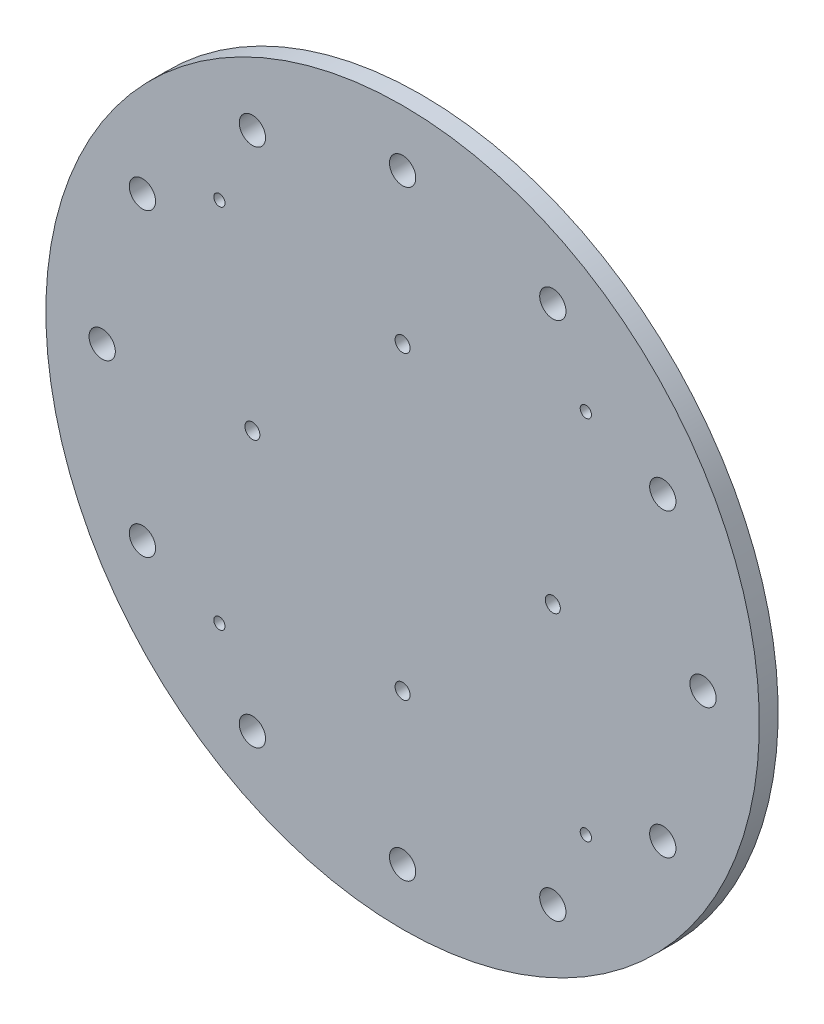
ISO-10303-21;
HEADER;
FILE_DESCRIPTION(('STEP AP214'),'2;1');
FILE_NAME('part.step','',(''),(''),'','','');
FILE_SCHEMA(('AUTOMOTIVE_DESIGN { 1 0 10303 214 1 1 1 1 }'));
ENDSEC;
DATA;
#1=APPLICATION_CONTEXT('core data for automotive mechanical design processes');
#2=APPLICATION_PROTOCOL_DEFINITION('international standard','automotive_design',2000,#1);
#3=PRODUCT_CONTEXT('',#1,'mechanical');
#4=PRODUCT('Part','Part','',(#3));
#5=PRODUCT_RELATED_PRODUCT_CATEGORY('part','',(#4));
#6=PRODUCT_DEFINITION_FORMATION('','',#4);
#7=PRODUCT_DEFINITION_CONTEXT('part definition',#1,'design');
#8=PRODUCT_DEFINITION('design','',#6,#7);
#9=PRODUCT_DEFINITION_SHAPE('','',#8);
#10=(LENGTH_UNIT() NAMED_UNIT(*) SI_UNIT(.MILLI.,.METRE.));
#11=(NAMED_UNIT(*) PLANE_ANGLE_UNIT() SI_UNIT($,.RADIAN.));
#12=(NAMED_UNIT(*) SI_UNIT($,.STERADIAN.) SOLID_ANGLE_UNIT());
#13=UNCERTAINTY_MEASURE_WITH_UNIT(LENGTH_MEASURE(1.E-05),#10,'distance_accuracy_value','');
#14=(GEOMETRIC_REPRESENTATION_CONTEXT(3) GLOBAL_UNCERTAINTY_ASSIGNED_CONTEXT((#13)) GLOBAL_UNIT_ASSIGNED_CONTEXT((#10,
#11,#12)) REPRESENTATION_CONTEXT('',''));
#15=CARTESIAN_POINT('',(0.,0.,0.));
#16=DIRECTION('',(0.,0.,1.));
#17=DIRECTION('',(1.,0.,0.));
#18=AXIS2_PLACEMENT_3D('',#15,#16,#17);
#19=CARTESIAN_POINT('',(-48.7903679018713,51.2903679018705,2.50000000003424));
#20=DIRECTION('',(0.,7.01834423910697E-13,-1.));
#21=DIRECTION('',(0.,1.,7.01834423910697E-13));
#22=AXIS2_PLACEMENT_3D('',#19,#20,#21);
#23=CYLINDRICAL_SURFACE('',#22,1.49999999999999);
#24=CARTESIAN_POINT('',(-48.7903679018713,51.2903679018705,2.50000000003424));
#25=DIRECTION('',(0.,-7.01834423910697E-13,1.));
#26=DIRECTION('',(0.,-1.,-7.01834423910697E-13));
#27=AXIS2_PLACEMENT_3D('',#24,#25,#26);
#28=CIRCLE('',#27,1.49999999999999);
#29=CARTESIAN_POINT('',(-48.7903679018713,49.7903679018705,2.50000000003319));
#30=VERTEX_POINT('',#29);
#31=EDGE_CURVE('E51',#30,#30,#28,.T.);
#32=ORIENTED_EDGE('',*,*,#31,.T.);
#33=EDGE_LOOP('',(#32));
#34=FACE_BOUND('',#33,.T.);
#35=CARTESIAN_POINT('',(-48.7903679018713,51.290367901874,-2.49999999996576));
#36=DIRECTION('',(0.,-7.01834423910697E-13,1.));
#37=DIRECTION('',(0.,-1.,-7.01834423910697E-13));
#38=AXIS2_PLACEMENT_3D('',#35,#36,#37);
#39=CIRCLE('',#38,1.49999999999999);
#40=CARTESIAN_POINT('',(-48.7903679018713,49.790367901874,-2.49999999996682));
#41=VERTEX_POINT('',#40);
#42=EDGE_CURVE('E136',#41,#41,#39,.T.);
#43=ORIENTED_EDGE('',*,*,#42,.F.);
#44=EDGE_LOOP('',(#43));
#45=FACE_BOUND('',#44,.T.);
#46=ADVANCED_FACE('F42',(#34,#45),#23,.F.);
#47=CARTESIAN_POINT('',(-48.7903679018718,-46.2903679018736,2.49999999996575));
#48=DIRECTION('',(0.,7.01834423910697E-13,-1.));
#49=DIRECTION('',(0.,1.,7.01834423910697E-13));
#50=AXIS2_PLACEMENT_3D('',#47,#48,#49);
#51=CYLINDRICAL_SURFACE('',#50,1.50000000000018);
#52=CARTESIAN_POINT('',(-48.7903679018718,-46.2903679018736,2.49999999996575));
#53=DIRECTION('',(0.,-7.01834423910697E-13,1.));
#54=DIRECTION('',(0.,-1.,-7.01834423910697E-13));
#55=AXIS2_PLACEMENT_3D('',#52,#53,#54);
#56=CIRCLE('',#55,1.50000000000018);
#57=CARTESIAN_POINT('',(-48.7903679018718,-47.7903679018737,2.4999999999647));
#58=VERTEX_POINT('',#57);
#59=EDGE_CURVE('E57',#58,#58,#56,.T.);
#60=ORIENTED_EDGE('',*,*,#59,.T.);
#61=EDGE_LOOP('',(#60));
#62=FACE_BOUND('',#61,.T.);
#63=CARTESIAN_POINT('',(-48.7903679018718,-46.29036790187,-2.50000000003425));
#64=DIRECTION('',(0.,-7.01834423910697E-13,1.));
#65=DIRECTION('',(0.,-1.,-7.01834423910697E-13));
#66=AXIS2_PLACEMENT_3D('',#63,#64,#65);
#67=CIRCLE('',#66,1.50000000000018);
#68=CARTESIAN_POINT('',(-48.7903679018718,-47.7903679018702,-2.5000000000353));
#69=VERTEX_POINT('',#68);
#70=EDGE_CURVE('E133',#69,#69,#67,.T.);
#71=ORIENTED_EDGE('',*,*,#70,.F.);
#72=EDGE_LOOP('',(#71));
#73=FACE_BOUND('',#72,.T.);
#74=ADVANCED_FACE('F223',(#62,#73),#51,.F.);
#75=CARTESIAN_POINT('',(48.7903679018717,-46.2903679018736,2.49999999996575));
#76=DIRECTION('',(0.,7.01834423910697E-13,-1.));
#77=DIRECTION('',(0.,1.,7.01834423910697E-13));
#78=AXIS2_PLACEMENT_3D('',#75,#76,#77);
#79=CYLINDRICAL_SURFACE('',#78,1.5);
#80=CARTESIAN_POINT('',(48.7903679018717,-46.2903679018736,2.49999999996575));
#81=DIRECTION('',(0.,-7.01834423910697E-13,1.));
#82=DIRECTION('',(0.,-1.,-7.01834423910697E-13));
#83=AXIS2_PLACEMENT_3D('',#80,#81,#82);
#84=CIRCLE('',#83,1.5);
#85=CARTESIAN_POINT('',(48.7903679018717,-47.7903679018736,2.4999999999647));
#86=VERTEX_POINT('',#85);
#87=EDGE_CURVE('E216',#86,#86,#84,.T.);
#88=ORIENTED_EDGE('',*,*,#87,.T.);
#89=EDGE_LOOP('',(#88));
#90=FACE_BOUND('',#89,.T.);
#91=CARTESIAN_POINT('',(48.7903679018717,-46.2903679018701,-2.50000000003425));
#92=DIRECTION('',(0.,-7.01834423910697E-13,1.));
#93=DIRECTION('',(0.,-1.,-7.01834423910697E-13));
#94=AXIS2_PLACEMENT_3D('',#91,#92,#93);
#95=CIRCLE('',#94,1.5);
#96=CARTESIAN_POINT('',(48.7903679018717,-47.7903679018701,-2.5000000000353));
#97=VERTEX_POINT('',#96);
#98=EDGE_CURVE('E129',#97,#97,#95,.T.);
#99=ORIENTED_EDGE('',*,*,#98,.F.);
#100=EDGE_LOOP('',(#99));
#101=FACE_BOUND('',#100,.T.);
#102=ADVANCED_FACE('F241',(#90,#101),#79,.F.);
#103=CARTESIAN_POINT('',(-40.0000000000011,2.49999999999824,2.5));
#104=DIRECTION('',(0.,7.01834423910697E-13,-1.));
#105=DIRECTION('',(0.,1.,7.01834423910697E-13));
#106=AXIS2_PLACEMENT_3D('',#103,#104,#105);
#107=CYLINDRICAL_SURFACE('',#106,2.00000000000008);
#108=CARTESIAN_POINT('',(-40.0000000000011,2.49999999999824,2.5));
#109=DIRECTION('',(0.,-7.01834423910697E-13,1.));
#110=DIRECTION('',(0.,-1.,-7.01834423910697E-13));
#111=AXIS2_PLACEMENT_3D('',#108,#109,#110);
#112=CIRCLE('',#111,2.00000000000008);
#113=CARTESIAN_POINT('',(-40.0000000000011,0.499999999998163,2.49999999999859));
#114=VERTEX_POINT('',#113);
#115=EDGE_CURVE('E212',#114,#114,#112,.T.);
#116=ORIENTED_EDGE('',*,*,#115,.T.);
#117=EDGE_LOOP('',(#116));
#118=FACE_BOUND('',#117,.T.);
#119=CARTESIAN_POINT('',(-40.0000000000011,2.50000000000175,-2.50000000000001));
#120=DIRECTION('',(0.,-7.01834423910697E-13,1.));
#121=DIRECTION('',(0.,-1.,-7.01834423910697E-13));
#122=AXIS2_PLACEMENT_3D('',#119,#120,#121);
#123=CIRCLE('',#122,2.00000000000008);
#124=CARTESIAN_POINT('',(-40.0000000000011,0.500000000001672,-2.50000000000141));
#125=VERTEX_POINT('',#124);
#126=EDGE_CURVE('E125',#125,#125,#123,.T.);
#127=ORIENTED_EDGE('',*,*,#126,.F.);
#128=EDGE_LOOP('',(#127));
#129=FACE_BOUND('',#128,.T.);
#130=ADVANCED_FACE('F248',(#118,#129),#107,.F.);
#131=CARTESIAN_POINT('',(-2.79318507107451E-13,-37.5000000000018,2.49999999997192));
#132=DIRECTION('',(0.,7.01834423910697E-13,-1.));
#133=DIRECTION('',(0.,1.,7.01834423910697E-13));
#134=AXIS2_PLACEMENT_3D('',#131,#132,#133);
#135=CYLINDRICAL_SURFACE('',#134,2.);
#136=CARTESIAN_POINT('',(-2.79318507107451E-13,-37.5000000000018,2.49999999997192));
#137=DIRECTION('',(0.,-7.01834423910697E-13,1.));
#138=DIRECTION('',(0.,-1.,-7.01834423910697E-13));
#139=AXIS2_PLACEMENT_3D('',#136,#137,#138);
#140=CIRCLE('',#139,2.);
#141=CARTESIAN_POINT('',(-2.79318507107451E-13,-39.5000000000018,2.49999999997052));
#142=VERTEX_POINT('',#141);
#143=EDGE_CURVE('E208',#142,#142,#140,.T.);
#144=ORIENTED_EDGE('',*,*,#143,.T.);
#145=EDGE_LOOP('',(#144));
#146=FACE_BOUND('',#145,.T.);
#147=CARTESIAN_POINT('',(-2.79318507107451E-13,-37.4999999999983,-2.50000000002808));
#148=DIRECTION('',(0.,-7.01834423910697E-13,1.));
#149=DIRECTION('',(0.,-1.,-7.01834423910697E-13));
#150=AXIS2_PLACEMENT_3D('',#147,#148,#149);
#151=CIRCLE('',#150,2.);
#152=CARTESIAN_POINT('',(-2.79318507107451E-13,-39.4999999999982,-2.50000000002948));
#153=VERTEX_POINT('',#152);
#154=EDGE_CURVE('E121',#153,#153,#151,.T.);
#155=ORIENTED_EDGE('',*,*,#154,.F.);
#156=EDGE_LOOP('',(#155));
#157=FACE_BOUND('',#156,.T.);
#158=ADVANCED_FACE('F252',(#146,#157),#135,.F.);
#159=CARTESIAN_POINT('',(40.,2.49999999999811,2.5));
#160=DIRECTION('',(0.,7.01834423910697E-13,-1.));
#161=DIRECTION('',(0.,1.,7.01834423910697E-13));
#162=AXIS2_PLACEMENT_3D('',#159,#160,#161);
#163=CYLINDRICAL_SURFACE('',#162,2.);
#164=CARTESIAN_POINT('',(40.,2.49999999999811,2.5));
#165=DIRECTION('',(0.,-7.01834423910697E-13,1.));
#166=DIRECTION('',(0.,-1.,-7.01834423910697E-13));
#167=AXIS2_PLACEMENT_3D('',#164,#165,#166);
#168=CIRCLE('',#167,2.);
#169=CARTESIAN_POINT('',(40.,0.499999999998109,2.49999999999859));
#170=VERTEX_POINT('',#169);
#171=EDGE_CURVE('E204',#170,#170,#168,.T.);
#172=ORIENTED_EDGE('',*,*,#171,.T.);
#173=EDGE_LOOP('',(#172));
#174=FACE_BOUND('',#173,.T.);
#175=CARTESIAN_POINT('',(40.,2.50000000000162,-2.50000000000001));
#176=DIRECTION('',(0.,-7.01834423910697E-13,1.));
#177=DIRECTION('',(0.,-1.,-7.01834423910697E-13));
#178=AXIS2_PLACEMENT_3D('',#175,#176,#177);
#179=CIRCLE('',#178,2.);
#180=CARTESIAN_POINT('',(40.,0.500000000001618,-2.50000000000141));
#181=VERTEX_POINT('',#180);
#182=EDGE_CURVE('E117',#181,#181,#179,.T.);
#183=ORIENTED_EDGE('',*,*,#182,.F.);
#184=EDGE_LOOP('',(#183));
#185=FACE_BOUND('',#184,.T.);
#186=ADVANCED_FACE('F256',(#174,#185),#163,.F.);
#187=CARTESIAN_POINT('',(0.,42.4999999999983,2.50000000002807));
#188=DIRECTION('',(0.,7.01834423910697E-13,-1.));
#189=DIRECTION('',(0.,1.,7.01834423910697E-13));
#190=AXIS2_PLACEMENT_3D('',#187,#188,#189);
#191=CYLINDRICAL_SURFACE('',#190,2.);
#192=CARTESIAN_POINT('',(0.,42.4999999999983,2.50000000002807));
#193=DIRECTION('',(0.,-7.01834423910697E-13,1.));
#194=DIRECTION('',(0.,-1.,-7.01834423910697E-13));
#195=AXIS2_PLACEMENT_3D('',#192,#193,#194);
#196=CIRCLE('',#195,2.);
#197=CARTESIAN_POINT('',(0.,40.4999999999983,2.50000000002666));
#198=VERTEX_POINT('',#197);
#199=EDGE_CURVE('E200',#198,#198,#196,.T.);
#200=ORIENTED_EDGE('',*,*,#199,.T.);
#201=EDGE_LOOP('',(#200));
#202=FACE_BOUND('',#201,.T.);
#203=CARTESIAN_POINT('',(0.,42.5000000000018,-2.49999999997193));
#204=DIRECTION('',(0.,-7.01834423910697E-13,1.));
#205=DIRECTION('',(0.,-1.,-7.01834423910697E-13));
#206=AXIS2_PLACEMENT_3D('',#203,#204,#205);
#207=CIRCLE('',#206,2.);
#208=CARTESIAN_POINT('',(0.,40.5000000000018,-2.49999999997334));
#209=VERTEX_POINT('',#208);
#210=EDGE_CURVE('E113',#209,#209,#207,.T.);
#211=ORIENTED_EDGE('',*,*,#210,.F.);
#212=EDGE_LOOP('',(#211));
#213=FACE_BOUND('',#212,.T.);
#214=ADVANCED_FACE('F260',(#202,#213),#191,.F.);
#215=CARTESIAN_POINT('',(48.7903679018717,51.2903679018701,2.50000000003424));
#216=DIRECTION('',(0.,7.01834423910697E-13,-1.));
#217=DIRECTION('',(0.,1.,7.01834423910697E-13));
#218=AXIS2_PLACEMENT_3D('',#215,#216,#217);
#219=CYLINDRICAL_SURFACE('',#218,1.5);
#220=CARTESIAN_POINT('',(48.7903679018717,51.2903679018701,2.50000000003424));
#221=DIRECTION('',(0.,-7.01834423910697E-13,1.));
#222=DIRECTION('',(0.,-1.,-7.01834423910697E-13));
#223=AXIS2_PLACEMENT_3D('',#220,#221,#222);
#224=CIRCLE('',#223,1.5);
#225=CARTESIAN_POINT('',(48.7903679018717,49.7903679018701,2.50000000003319));
#226=VERTEX_POINT('',#225);
#227=EDGE_CURVE('E196',#226,#226,#224,.T.);
#228=ORIENTED_EDGE('',*,*,#227,.T.);
#229=EDGE_LOOP('',(#228));
#230=FACE_BOUND('',#229,.T.);
#231=CARTESIAN_POINT('',(48.7903679018717,51.2903679018736,-2.49999999996576));
#232=DIRECTION('',(0.,-7.01834423910697E-13,1.));
#233=DIRECTION('',(0.,-1.,-7.01834423910697E-13));
#234=AXIS2_PLACEMENT_3D('',#231,#232,#233);
#235=CIRCLE('',#234,1.5);
#236=CARTESIAN_POINT('',(48.7903679018717,49.7903679018736,-2.49999999996682));
#237=VERTEX_POINT('',#236);
#238=EDGE_CURVE('E109',#237,#237,#235,.T.);
#239=ORIENTED_EDGE('',*,*,#238,.F.);
#240=EDGE_LOOP('',(#239));
#241=FACE_BOUND('',#240,.T.);
#242=ADVANCED_FACE('F264',(#230,#241),#219,.F.);
#243=CARTESIAN_POINT('',(80.,2.49999999999825,2.5));
#244=DIRECTION('',(0.,7.01834423910697E-13,-1.));
#245=DIRECTION('',(0.,1.,7.01834423910697E-13));
#246=AXIS2_PLACEMENT_3D('',#243,#244,#245);
#247=CYLINDRICAL_SURFACE('',#246,3.49999999999999);
#248=CARTESIAN_POINT('',(80.,2.49999999999825,2.5));
#249=DIRECTION('',(0.,-7.01834423910697E-13,1.));
#250=DIRECTION('',(0.,-1.,-7.01834423910697E-13));
#251=AXIS2_PLACEMENT_3D('',#248,#249,#250);
#252=CIRCLE('',#251,3.49999999999999);
#253=CARTESIAN_POINT('',(80.,-1.00000000000175,2.49999999999754));
#254=VERTEX_POINT('',#253);
#255=EDGE_CURVE('E192',#254,#254,#252,.T.);
#256=ORIENTED_EDGE('',*,*,#255,.T.);
#257=EDGE_LOOP('',(#256));
#258=FACE_BOUND('',#257,.T.);
#259=CARTESIAN_POINT('',(80.,2.50000000000176,-2.50000000000001));
#260=DIRECTION('',(0.,-7.01834423910697E-13,1.));
#261=DIRECTION('',(0.,-1.,-7.01834423910697E-13));
#262=AXIS2_PLACEMENT_3D('',#259,#260,#261);
#263=CIRCLE('',#262,3.49999999999999);
#264=CARTESIAN_POINT('',(80.,-0.999999999998238,-2.50000000000246));
#265=VERTEX_POINT('',#264);
#266=EDGE_CURVE('E105',#265,#265,#263,.T.);
#267=ORIENTED_EDGE('',*,*,#266,.F.);
#268=EDGE_LOOP('',(#267));
#269=FACE_BOUND('',#268,.T.);
#270=ADVANCED_FACE('F268',(#258,#269),#247,.F.);
#271=CARTESIAN_POINT('',(69.2820323027551,-37.5000000000019,2.49999999997192));
#272=DIRECTION('',(0.,7.01834423910697E-13,-1.));
#273=DIRECTION('',(0.,1.,7.01834423910697E-13));
#274=AXIS2_PLACEMENT_3D('',#271,#272,#273);
#275=CYLINDRICAL_SURFACE('',#274,3.49999999999998);
#276=CARTESIAN_POINT('',(69.2820323027551,-37.5000000000019,2.49999999997192));
#277=DIRECTION('',(0.,-7.01834423910697E-13,1.));
#278=DIRECTION('',(0.,-1.,-7.01834423910697E-13));
#279=AXIS2_PLACEMENT_3D('',#276,#277,#278);
#280=CIRCLE('',#279,3.49999999999998);
#281=CARTESIAN_POINT('',(69.2820323027551,-41.0000000000018,2.49999999996947));
#282=VERTEX_POINT('',#281);
#283=EDGE_CURVE('E188',#282,#282,#280,.T.);
#284=ORIENTED_EDGE('',*,*,#283,.T.);
#285=EDGE_LOOP('',(#284));
#286=FACE_BOUND('',#285,.T.);
#287=CARTESIAN_POINT('',(69.2820323027551,-37.4999999999983,-2.50000000002808));
#288=DIRECTION('',(0.,-7.01834423910697E-13,1.));
#289=DIRECTION('',(0.,-1.,-7.01834423910697E-13));
#290=AXIS2_PLACEMENT_3D('',#287,#288,#289);
#291=CIRCLE('',#290,3.49999999999998);
#292=CARTESIAN_POINT('',(69.2820323027551,-40.9999999999983,-2.50000000003054));
#293=VERTEX_POINT('',#292);
#294=EDGE_CURVE('E101',#293,#293,#291,.T.);
#295=ORIENTED_EDGE('',*,*,#294,.F.);
#296=EDGE_LOOP('',(#295));
#297=FACE_BOUND('',#296,.T.);
#298=ADVANCED_FACE('F272',(#286,#297),#275,.F.);
#299=CARTESIAN_POINT('',(39.9999999999998,-66.782032302757,2.49999999995137));
#300=DIRECTION('',(0.,7.01834423910697E-13,-1.));
#301=DIRECTION('',(0.,1.,7.01834423910697E-13));
#302=AXIS2_PLACEMENT_3D('',#299,#300,#301);
#303=CYLINDRICAL_SURFACE('',#302,3.49999999999999);
#304=CARTESIAN_POINT('',(39.9999999999998,-66.782032302757,2.49999999995137));
#305=DIRECTION('',(0.,-7.01834423910697E-13,1.));
#306=DIRECTION('',(0.,-1.,-7.01834423910697E-13));
#307=AXIS2_PLACEMENT_3D('',#304,#305,#306);
#308=CIRCLE('',#307,3.49999999999999);
#309=CARTESIAN_POINT('',(39.9999999999998,-70.2820323027569,2.49999999994892));
#310=VERTEX_POINT('',#309);
#311=EDGE_CURVE('E184',#310,#310,#308,.T.);
#312=ORIENTED_EDGE('',*,*,#311,.T.);
#313=EDGE_LOOP('',(#312));
#314=FACE_BOUND('',#313,.T.);
#315=CARTESIAN_POINT('',(39.9999999999998,-66.7820323027534,-2.50000000004863));
#316=DIRECTION('',(0.,-7.01834423910697E-13,1.));
#317=DIRECTION('',(0.,-1.,-7.01834423910697E-13));
#318=AXIS2_PLACEMENT_3D('',#315,#316,#317);
#319=CIRCLE('',#318,3.49999999999999);
#320=CARTESIAN_POINT('',(39.9999999999998,-70.2820323027534,-2.50000000005109));
#321=VERTEX_POINT('',#320);
#322=EDGE_CURVE('E97',#321,#321,#319,.T.);
#323=ORIENTED_EDGE('',*,*,#322,.F.);
#324=EDGE_LOOP('',(#323));
#325=FACE_BOUND('',#324,.T.);
#326=ADVANCED_FACE('F276',(#314,#325),#303,.F.);
#327=CARTESIAN_POINT('',(-2.79318507107451E-13,-77.5000000000018,2.49999999994385));
#328=DIRECTION('',(0.,7.01834423910697E-13,-1.));
#329=DIRECTION('',(0.,1.,7.01834423910697E-13));
#330=AXIS2_PLACEMENT_3D('',#327,#328,#329);
#331=CYLINDRICAL_SURFACE('',#330,3.49999999999999);
#332=CARTESIAN_POINT('',(-2.79318507107451E-13,-77.5000000000018,2.49999999994385));
#333=DIRECTION('',(0.,-7.01834423910697E-13,1.));
#334=DIRECTION('',(0.,-1.,-7.01834423910697E-13));
#335=AXIS2_PLACEMENT_3D('',#332,#333,#334);
#336=CIRCLE('',#335,3.49999999999999);
#337=CARTESIAN_POINT('',(-2.79318507107451E-13,-81.0000000000018,2.49999999994139));
#338=VERTEX_POINT('',#337);
#339=EDGE_CURVE('E180',#338,#338,#336,.T.);
#340=ORIENTED_EDGE('',*,*,#339,.T.);
#341=EDGE_LOOP('',(#340));
#342=FACE_BOUND('',#341,.T.);
#343=CARTESIAN_POINT('',(-2.79318507107451E-13,-77.4999999999983,-2.50000000005615));
#344=DIRECTION('',(0.,-7.01834423910697E-13,1.));
#345=DIRECTION('',(0.,-1.,-7.01834423910697E-13));
#346=AXIS2_PLACEMENT_3D('',#343,#344,#345);
#347=CIRCLE('',#346,3.49999999999999);
#348=CARTESIAN_POINT('',(-2.79318507107451E-13,-80.9999999999983,-2.50000000005861));
#349=VERTEX_POINT('',#348);
#350=EDGE_CURVE('E93',#349,#349,#347,.T.);
#351=ORIENTED_EDGE('',*,*,#350,.F.);
#352=EDGE_LOOP('',(#351));
#353=FACE_BOUND('',#352,.T.);
#354=ADVANCED_FACE('F280',(#342,#353),#331,.F.);
#355=CARTESIAN_POINT('',(-40.0000000000003,-66.7820323027567,2.49999999995137));
#356=DIRECTION('',(0.,7.01834423910697E-13,-1.));
#357=DIRECTION('',(0.,1.,7.01834423910697E-13));
#358=AXIS2_PLACEMENT_3D('',#355,#356,#357);
#359=CYLINDRICAL_SURFACE('',#358,3.49999999999999);
#360=CARTESIAN_POINT('',(-40.0000000000003,-66.7820323027567,2.49999999995137));
#361=DIRECTION('',(0.,-7.01834423910697E-13,1.));
#362=DIRECTION('',(0.,-1.,-7.01834423910697E-13));
#363=AXIS2_PLACEMENT_3D('',#360,#361,#362);
#364=CIRCLE('',#363,3.49999999999999);
#365=CARTESIAN_POINT('',(-40.0000000000003,-70.2820323027567,2.49999999994892));
#366=VERTEX_POINT('',#365);
#367=EDGE_CURVE('E176',#366,#366,#364,.T.);
#368=ORIENTED_EDGE('',*,*,#367,.T.);
#369=EDGE_LOOP('',(#368));
#370=FACE_BOUND('',#369,.T.);
#371=CARTESIAN_POINT('',(-40.0000000000003,-66.7820323027532,-2.50000000004863));
#372=DIRECTION('',(0.,-7.01834423910697E-13,1.));
#373=DIRECTION('',(0.,-1.,-7.01834423910697E-13));
#374=AXIS2_PLACEMENT_3D('',#371,#372,#373);
#375=CIRCLE('',#374,3.49999999999999);
#376=CARTESIAN_POINT('',(-40.0000000000003,-70.2820323027532,-2.50000000005109));
#377=VERTEX_POINT('',#376);
#378=EDGE_CURVE('E89',#377,#377,#375,.T.);
#379=ORIENTED_EDGE('',*,*,#378,.F.);
#380=EDGE_LOOP('',(#379));
#381=FACE_BOUND('',#380,.T.);
#382=ADVANCED_FACE('F284',(#370,#381),#359,.F.);
#383=CARTESIAN_POINT('',(-69.2820323027553,-37.5000000000014,2.49999999997192));
#384=DIRECTION('',(0.,7.01834423910697E-13,-1.));
#385=DIRECTION('',(0.,1.,7.01834423910697E-13));
#386=AXIS2_PLACEMENT_3D('',#383,#384,#385);
#387=CYLINDRICAL_SURFACE('',#386,3.5);
#388=CARTESIAN_POINT('',(-69.2820323027553,-37.5000000000014,2.49999999997192));
#389=DIRECTION('',(0.,-7.01834423910697E-13,1.));
#390=DIRECTION('',(0.,-1.,-7.01834423910697E-13));
#391=AXIS2_PLACEMENT_3D('',#388,#389,#390);
#392=CIRCLE('',#391,3.5);
#393=CARTESIAN_POINT('',(-69.2820323027553,-41.0000000000014,2.49999999996947));
#394=VERTEX_POINT('',#393);
#395=EDGE_CURVE('E172',#394,#394,#392,.T.);
#396=ORIENTED_EDGE('',*,*,#395,.T.);
#397=EDGE_LOOP('',(#396));
#398=FACE_BOUND('',#397,.T.);
#399=CARTESIAN_POINT('',(-69.2820323027553,-37.4999999999978,-2.50000000002808));
#400=DIRECTION('',(0.,-7.01834423910697E-13,1.));
#401=DIRECTION('',(0.,-1.,-7.01834423910697E-13));
#402=AXIS2_PLACEMENT_3D('',#399,#400,#401);
#403=CIRCLE('',#402,3.5);
#404=CARTESIAN_POINT('',(-69.2820323027553,-40.9999999999978,-2.50000000003054));
#405=VERTEX_POINT('',#404);
#406=EDGE_CURVE('E85',#405,#405,#403,.T.);
#407=ORIENTED_EDGE('',*,*,#406,.F.);
#408=EDGE_LOOP('',(#407));
#409=FACE_BOUND('',#408,.T.);
#410=ADVANCED_FACE('F288',(#398,#409),#387,.F.);
#411=CARTESIAN_POINT('',(-80.,2.49999999999881,2.5));
#412=DIRECTION('',(0.,7.01834423910697E-13,-1.));
#413=DIRECTION('',(0.,1.,7.01834423910697E-13));
#414=AXIS2_PLACEMENT_3D('',#411,#412,#413);
#415=CYLINDRICAL_SURFACE('',#414,3.5);
#416=CARTESIAN_POINT('',(-80.,2.49999999999881,2.5));
#417=DIRECTION('',(0.,-7.01834423910697E-13,1.));
#418=DIRECTION('',(0.,-1.,-7.01834423910697E-13));
#419=AXIS2_PLACEMENT_3D('',#416,#417,#418);
#420=CIRCLE('',#419,3.5);
#421=CARTESIAN_POINT('',(-80.,-1.00000000000119,2.49999999999754));
#422=VERTEX_POINT('',#421);
#423=EDGE_CURVE('E168',#422,#422,#420,.T.);
#424=ORIENTED_EDGE('',*,*,#423,.T.);
#425=EDGE_LOOP('',(#424));
#426=FACE_BOUND('',#425,.T.);
#427=CARTESIAN_POINT('',(-80.,2.50000000000231,-2.50000000000001));
#428=DIRECTION('',(0.,-7.01834423910697E-13,1.));
#429=DIRECTION('',(0.,-1.,-7.01834423910697E-13));
#430=AXIS2_PLACEMENT_3D('',#427,#428,#429);
#431=CIRCLE('',#430,3.5);
#432=CARTESIAN_POINT('',(-80.,-0.999999999997686,-2.50000000000246));
#433=VERTEX_POINT('',#432);
#434=EDGE_CURVE('E81',#433,#433,#431,.T.);
#435=ORIENTED_EDGE('',*,*,#434,.F.);
#436=EDGE_LOOP('',(#435));
#437=FACE_BOUND('',#436,.T.);
#438=ADVANCED_FACE('F292',(#426,#437),#415,.F.);
#439=CARTESIAN_POINT('',(-69.2820323027548,42.4999999999988,2.50000000002807));
#440=DIRECTION('',(0.,7.01834423910697E-13,-1.));
#441=DIRECTION('',(0.,1.,7.01834423910697E-13));
#442=AXIS2_PLACEMENT_3D('',#439,#440,#441);
#443=CYLINDRICAL_SURFACE('',#442,3.49999999999999);
#444=CARTESIAN_POINT('',(-69.2820323027548,42.4999999999988,2.50000000002807));
#445=DIRECTION('',(0.,-7.01834423910697E-13,1.));
#446=DIRECTION('',(0.,-1.,-7.01834423910697E-13));
#447=AXIS2_PLACEMENT_3D('',#444,#445,#446);
#448=CIRCLE('',#447,3.49999999999999);
#449=CARTESIAN_POINT('',(-69.2820323027548,38.9999999999988,2.50000000002561));
#450=VERTEX_POINT('',#449);
#451=EDGE_CURVE('E164',#450,#450,#448,.T.);
#452=ORIENTED_EDGE('',*,*,#451,.T.);
#453=EDGE_LOOP('',(#452));
#454=FACE_BOUND('',#453,.T.);
#455=CARTESIAN_POINT('',(-69.2820323027548,42.5000000000023,-2.49999999997193));
#456=DIRECTION('',(0.,-7.01834423910697E-13,1.));
#457=DIRECTION('',(0.,-1.,-7.01834423910697E-13));
#458=AXIS2_PLACEMENT_3D('',#455,#456,#457);
#459=CIRCLE('',#458,3.49999999999999);
#460=CARTESIAN_POINT('',(-69.2820323027548,39.0000000000023,-2.49999999997439));
#461=VERTEX_POINT('',#460);
#462=EDGE_CURVE('E77',#461,#461,#459,.T.);
#463=ORIENTED_EDGE('',*,*,#462,.F.);
#464=EDGE_LOOP('',(#463));
#465=FACE_BOUND('',#464,.T.);
#466=ADVANCED_FACE('F296',(#454,#465),#443,.F.);
#467=CARTESIAN_POINT('',(-39.9999999999994,71.7820323027537,2.50000000004862));
#468=DIRECTION('',(0.,7.01834423910697E-13,-1.));
#469=DIRECTION('',(0.,1.,7.01834423910697E-13));
#470=AXIS2_PLACEMENT_3D('',#467,#468,#469);
#471=CYLINDRICAL_SURFACE('',#470,3.49999999999999);
#472=CARTESIAN_POINT('',(-39.9999999999994,71.7820323027537,2.50000000004862));
#473=DIRECTION('',(0.,-7.01834423910697E-13,1.));
#474=DIRECTION('',(0.,-1.,-7.01834423910697E-13));
#475=AXIS2_PLACEMENT_3D('',#472,#473,#474);
#476=CIRCLE('',#475,3.49999999999999);
#477=CARTESIAN_POINT('',(-39.9999999999994,68.2820323027537,2.50000000004616));
#478=VERTEX_POINT('',#477);
#479=EDGE_CURVE('E160',#478,#478,#476,.T.);
#480=ORIENTED_EDGE('',*,*,#479,.T.);
#481=EDGE_LOOP('',(#480));
#482=FACE_BOUND('',#481,.T.);
#483=CARTESIAN_POINT('',(-39.9999999999994,71.7820323027572,-2.49999999995138));
#484=DIRECTION('',(0.,-7.01834423910697E-13,1.));
#485=DIRECTION('',(0.,-1.,-7.01834423910697E-13));
#486=AXIS2_PLACEMENT_3D('',#483,#484,#485);
#487=CIRCLE('',#486,3.49999999999999);
#488=CARTESIAN_POINT('',(-39.9999999999994,68.2820323027572,-2.49999999995384));
#489=VERTEX_POINT('',#488);
#490=EDGE_CURVE('E73',#489,#489,#487,.T.);
#491=ORIENTED_EDGE('',*,*,#490,.F.);
#492=EDGE_LOOP('',(#491));
#493=FACE_BOUND('',#492,.T.);
#494=ADVANCED_FACE('F300',(#482,#493),#471,.F.);
#495=CARTESIAN_POINT('',(8.37955521322352E-13,82.4999999999982,2.50000000005614));
#496=DIRECTION('',(0.,7.01834423910697E-13,-1.));
#497=DIRECTION('',(0.,1.,7.01834423910697E-13));
#498=AXIS2_PLACEMENT_3D('',#495,#496,#497);
#499=CYLINDRICAL_SURFACE('',#498,3.5);
#500=CARTESIAN_POINT('',(8.37955521322352E-13,82.4999999999982,2.50000000005614));
#501=DIRECTION('',(0.,-7.01834423910697E-13,1.));
#502=DIRECTION('',(0.,-1.,-7.01834423910697E-13));
#503=AXIS2_PLACEMENT_3D('',#500,#501,#502);
#504=CIRCLE('',#503,3.5);
#505=CARTESIAN_POINT('',(8.37955521322352E-13,78.9999999999982,2.50000000005369));
#506=VERTEX_POINT('',#505);
#507=EDGE_CURVE('E154',#506,#506,#504,.T.);
#508=ORIENTED_EDGE('',*,*,#507,.T.);
#509=EDGE_LOOP('',(#508));
#510=FACE_BOUND('',#509,.T.);
#511=CARTESIAN_POINT('',(8.37955521322352E-13,82.5000000000017,-2.49999999994386));
#512=DIRECTION('',(0.,-7.01834423910697E-13,1.));
#513=DIRECTION('',(0.,-1.,-7.01834423910697E-13));
#514=AXIS2_PLACEMENT_3D('',#511,#512,#513);
#515=CIRCLE('',#514,3.5);
#516=CARTESIAN_POINT('',(8.37955521322352E-13,79.0000000000017,-2.49999999994631));
#517=VERTEX_POINT('',#516);
#518=EDGE_CURVE('E69',#517,#517,#515,.T.);
#519=ORIENTED_EDGE('',*,*,#518,.F.);
#520=EDGE_LOOP('',(#519));
#521=FACE_BOUND('',#520,.T.);
#522=ADVANCED_FACE('F304',(#510,#521),#499,.F.);
#523=CARTESIAN_POINT('',(40.0000000000008,71.7820323027529,2.50000000004862));
#524=DIRECTION('',(0.,7.01834423910697E-13,-1.));
#525=DIRECTION('',(0.,1.,7.01834423910697E-13));
#526=AXIS2_PLACEMENT_3D('',#523,#524,#525);
#527=CYLINDRICAL_SURFACE('',#526,3.49999999999999);
#528=CARTESIAN_POINT('',(40.0000000000008,71.7820323027529,2.50000000004862));
#529=DIRECTION('',(0.,-7.01834423910697E-13,1.));
#530=DIRECTION('',(0.,-1.,-7.01834423910697E-13));
#531=AXIS2_PLACEMENT_3D('',#528,#529,#530);
#532=CIRCLE('',#531,3.49999999999999);
#533=CARTESIAN_POINT('',(40.0000000000008,68.2820323027529,2.50000000004616));
#534=VERTEX_POINT('',#533);
#535=EDGE_CURVE('E148',#534,#534,#532,.T.);
#536=ORIENTED_EDGE('',*,*,#535,.T.);
#537=EDGE_LOOP('',(#536));
#538=FACE_BOUND('',#537,.T.);
#539=CARTESIAN_POINT('',(40.0000000000008,71.7820323027564,-2.49999999995138));
#540=DIRECTION('',(0.,-7.01834423910697E-13,1.));
#541=DIRECTION('',(0.,-1.,-7.01834423910697E-13));
#542=AXIS2_PLACEMENT_3D('',#539,#540,#541);
#543=CIRCLE('',#542,3.49999999999999);
#544=CARTESIAN_POINT('',(40.0000000000008,68.2820323027564,-2.49999999995384));
#545=VERTEX_POINT('',#544);
#546=EDGE_CURVE('E65',#545,#545,#543,.T.);
#547=ORIENTED_EDGE('',*,*,#546,.F.);
#548=EDGE_LOOP('',(#547));
#549=FACE_BOUND('',#548,.T.);
#550=ADVANCED_FACE('F307',(#538,#549),#527,.F.);
#551=CARTESIAN_POINT('',(69.2820323027556,42.4999999999974,2.50000000002807));
#552=DIRECTION('',(0.,7.01834423910697E-13,-1.));
#553=DIRECTION('',(0.,1.,7.01834423910697E-13));
#554=AXIS2_PLACEMENT_3D('',#551,#552,#553);
#555=CYLINDRICAL_SURFACE('',#554,3.49999999999999);
#556=CARTESIAN_POINT('',(69.2820323027556,42.4999999999974,2.50000000002807));
#557=DIRECTION('',(0.,-7.01834423910697E-13,1.));
#558=DIRECTION('',(0.,-1.,-7.01834423910697E-13));
#559=AXIS2_PLACEMENT_3D('',#556,#557,#558);
#560=CIRCLE('',#559,3.49999999999999);
#561=CARTESIAN_POINT('',(69.2820323027556,38.9999999999974,2.50000000002561));
#562=VERTEX_POINT('',#561);
#563=EDGE_CURVE('E143',#562,#562,#560,.T.);
#564=ORIENTED_EDGE('',*,*,#563,.T.);
#565=EDGE_LOOP('',(#564));
#566=FACE_BOUND('',#565,.T.);
#567=CARTESIAN_POINT('',(69.2820323027556,42.5000000000009,-2.49999999997193));
#568=DIRECTION('',(0.,-7.01834423910697E-13,1.));
#569=DIRECTION('',(0.,-1.,-7.01834423910697E-13));
#570=AXIS2_PLACEMENT_3D('',#567,#568,#569);
#571=CIRCLE('',#570,3.49999999999999);
#572=CARTESIAN_POINT('',(69.2820323027556,39.0000000000009,-2.49999999997439));
#573=VERTEX_POINT('',#572);
#574=EDGE_CURVE('E61',#573,#573,#571,.T.);
#575=ORIENTED_EDGE('',*,*,#574,.F.);
#576=EDGE_LOOP('',(#575));
#577=FACE_BOUND('',#576,.T.);
#578=ADVANCED_FACE('F44',(#566,#577),#555,.F.);
#579=CARTESIAN_POINT('',(0.,2.49999999999825,2.5));
#580=DIRECTION('',(0.,7.01834423910697E-13,-1.));
#581=DIRECTION('',(0.,1.,7.01834423910697E-13));
#582=AXIS2_PLACEMENT_3D('',#579,#580,#581);
#583=CYLINDRICAL_SURFACE('',#582,95.);
#584=CARTESIAN_POINT('',(0.,2.49999999999825,2.5));
#585=DIRECTION('',(0.,-7.01834423910697E-13,1.));
#586=DIRECTION('',(0.,-1.,-7.01834423910697E-13));
#587=AXIS2_PLACEMENT_3D('',#584,#585,#586);
#588=CIRCLE('',#587,95.);
#589=CARTESIAN_POINT('',(0.,-92.5000000000018,2.49999999993332));
#590=VERTEX_POINT('',#589);
#591=EDGE_CURVE('E10',#590,#590,#588,.T.);
#592=ORIENTED_EDGE('',*,*,#591,.F.);
#593=EDGE_LOOP('',(#592));
#594=FACE_BOUND('',#593,.T.);
#595=CARTESIAN_POINT('',(0.,2.50000000000176,-2.50000000000001));
#596=DIRECTION('',(0.,-7.01834423910697E-13,1.));
#597=DIRECTION('',(0.,-1.,-7.01834423910697E-13));
#598=AXIS2_PLACEMENT_3D('',#595,#596,#597);
#599=CIRCLE('',#598,95.);
#600=CARTESIAN_POINT('',(0.,-92.4999999999983,-2.50000000006668));
#601=VERTEX_POINT('',#600);
#602=EDGE_CURVE('E46',#601,#601,#599,.T.);
#603=ORIENTED_EDGE('',*,*,#602,.T.);
#604=EDGE_LOOP('',(#603));
#605=FACE_BOUND('',#604,.T.);
#606=ADVANCED_FACE('F230',(#594,#605),#583,.T.);
#607=CARTESIAN_POINT('',(0.,2.49999999999825,2.5));
#608=DIRECTION('',(0.,-7.01834423910697E-13,1.));
#609=DIRECTION('',(0.,-1.,-7.01834423910697E-13));
#610=AXIS2_PLACEMENT_3D('',#607,#608,#609);
#611=PLANE('',#610);
#612=ORIENTED_EDGE('',*,*,#563,.F.);
#613=EDGE_LOOP('',(#612));
#614=FACE_BOUND('',#613,.T.);
#615=ORIENTED_EDGE('',*,*,#535,.F.);
#616=EDGE_LOOP('',(#615));
#617=FACE_BOUND('',#616,.T.);
#618=ORIENTED_EDGE('',*,*,#507,.F.);
#619=EDGE_LOOP('',(#618));
#620=FACE_BOUND('',#619,.T.);
#621=ORIENTED_EDGE('',*,*,#479,.F.);
#622=EDGE_LOOP('',(#621));
#623=FACE_BOUND('',#622,.T.);
#624=ORIENTED_EDGE('',*,*,#451,.F.);
#625=EDGE_LOOP('',(#624));
#626=FACE_BOUND('',#625,.T.);
#627=ORIENTED_EDGE('',*,*,#423,.F.);
#628=EDGE_LOOP('',(#627));
#629=FACE_BOUND('',#628,.T.);
#630=ORIENTED_EDGE('',*,*,#395,.F.);
#631=EDGE_LOOP('',(#630));
#632=FACE_BOUND('',#631,.T.);
#633=ORIENTED_EDGE('',*,*,#367,.F.);
#634=EDGE_LOOP('',(#633));
#635=FACE_BOUND('',#634,.T.);
#636=ORIENTED_EDGE('',*,*,#339,.F.);
#637=EDGE_LOOP('',(#636));
#638=FACE_BOUND('',#637,.T.);
#639=ORIENTED_EDGE('',*,*,#311,.F.);
#640=EDGE_LOOP('',(#639));
#641=FACE_BOUND('',#640,.T.);
#642=ORIENTED_EDGE('',*,*,#283,.F.);
#643=EDGE_LOOP('',(#642));
#644=FACE_BOUND('',#643,.T.);
#645=ORIENTED_EDGE('',*,*,#255,.F.);
#646=EDGE_LOOP('',(#645));
#647=FACE_BOUND('',#646,.T.);
#648=ORIENTED_EDGE('',*,*,#227,.F.);
#649=EDGE_LOOP('',(#648));
#650=FACE_BOUND('',#649,.T.);
#651=ORIENTED_EDGE('',*,*,#199,.F.);
#652=EDGE_LOOP('',(#651));
#653=FACE_BOUND('',#652,.T.);
#654=ORIENTED_EDGE('',*,*,#171,.F.);
#655=EDGE_LOOP('',(#654));
#656=FACE_BOUND('',#655,.T.);
#657=ORIENTED_EDGE('',*,*,#143,.F.);
#658=EDGE_LOOP('',(#657));
#659=FACE_BOUND('',#658,.T.);
#660=ORIENTED_EDGE('',*,*,#115,.F.);
#661=EDGE_LOOP('',(#660));
#662=FACE_BOUND('',#661,.T.);
#663=ORIENTED_EDGE('',*,*,#87,.F.);
#664=EDGE_LOOP('',(#663));
#665=FACE_BOUND('',#664,.T.);
#666=ORIENTED_EDGE('',*,*,#59,.F.);
#667=EDGE_LOOP('',(#666));
#668=FACE_BOUND('',#667,.T.);
#669=ORIENTED_EDGE('',*,*,#31,.F.);
#670=EDGE_LOOP('',(#669));
#671=FACE_BOUND('',#670,.T.);
#672=ORIENTED_EDGE('',*,*,#591,.T.);
#673=EDGE_LOOP('',(#672));
#674=FACE_BOUND('',#673,.T.);
#675=ADVANCED_FACE('F226',(#614,#617,#620,#623,#626,#629,#632,#635,#638,#641,#644,#647,#650,
#653,#656,#659,#662,#665,#668,#671,#674),#611,.T.);
#676=CARTESIAN_POINT('',(0.,2.50000000000176,-2.50000000000001));
#677=DIRECTION('',(0.,-7.01834423910697E-13,1.));
#678=DIRECTION('',(0.,-1.,-7.01834423910697E-13));
#679=AXIS2_PLACEMENT_3D('',#676,#677,#678);
#680=PLANE('',#679);
#681=ORIENTED_EDGE('',*,*,#574,.T.);
#682=EDGE_LOOP('',(#681));
#683=FACE_BOUND('',#682,.T.);
#684=ORIENTED_EDGE('',*,*,#546,.T.);
#685=EDGE_LOOP('',(#684));
#686=FACE_BOUND('',#685,.T.);
#687=ORIENTED_EDGE('',*,*,#518,.T.);
#688=EDGE_LOOP('',(#687));
#689=FACE_BOUND('',#688,.T.);
#690=ORIENTED_EDGE('',*,*,#490,.T.);
#691=EDGE_LOOP('',(#690));
#692=FACE_BOUND('',#691,.T.);
#693=ORIENTED_EDGE('',*,*,#462,.T.);
#694=EDGE_LOOP('',(#693));
#695=FACE_BOUND('',#694,.T.);
#696=ORIENTED_EDGE('',*,*,#434,.T.);
#697=EDGE_LOOP('',(#696));
#698=FACE_BOUND('',#697,.T.);
#699=ORIENTED_EDGE('',*,*,#406,.T.);
#700=EDGE_LOOP('',(#699));
#701=FACE_BOUND('',#700,.T.);
#702=ORIENTED_EDGE('',*,*,#378,.T.);
#703=EDGE_LOOP('',(#702));
#704=FACE_BOUND('',#703,.T.);
#705=ORIENTED_EDGE('',*,*,#350,.T.);
#706=EDGE_LOOP('',(#705));
#707=FACE_BOUND('',#706,.T.);
#708=ORIENTED_EDGE('',*,*,#322,.T.);
#709=EDGE_LOOP('',(#708));
#710=FACE_BOUND('',#709,.T.);
#711=ORIENTED_EDGE('',*,*,#294,.T.);
#712=EDGE_LOOP('',(#711));
#713=FACE_BOUND('',#712,.T.);
#714=ORIENTED_EDGE('',*,*,#266,.T.);
#715=EDGE_LOOP('',(#714));
#716=FACE_BOUND('',#715,.T.);
#717=ORIENTED_EDGE('',*,*,#238,.T.);
#718=EDGE_LOOP('',(#717));
#719=FACE_BOUND('',#718,.T.);
#720=ORIENTED_EDGE('',*,*,#210,.T.);
#721=EDGE_LOOP('',(#720));
#722=FACE_BOUND('',#721,.T.);
#723=ORIENTED_EDGE('',*,*,#182,.T.);
#724=EDGE_LOOP('',(#723));
#725=FACE_BOUND('',#724,.T.);
#726=ORIENTED_EDGE('',*,*,#154,.T.);
#727=EDGE_LOOP('',(#726));
#728=FACE_BOUND('',#727,.T.);
#729=ORIENTED_EDGE('',*,*,#126,.T.);
#730=EDGE_LOOP('',(#729));
#731=FACE_BOUND('',#730,.T.);
#732=ORIENTED_EDGE('',*,*,#98,.T.);
#733=EDGE_LOOP('',(#732));
#734=FACE_BOUND('',#733,.T.);
#735=ORIENTED_EDGE('',*,*,#70,.T.);
#736=EDGE_LOOP('',(#735));
#737=FACE_BOUND('',#736,.T.);
#738=ORIENTED_EDGE('',*,*,#42,.T.);
#739=EDGE_LOOP('',(#738));
#740=FACE_BOUND('',#739,.T.);
#741=ORIENTED_EDGE('',*,*,#602,.F.);
#742=EDGE_LOOP('',(#741));
#743=FACE_BOUND('',#742,.T.);
#744=ADVANCED_FACE('F229',(#683,#686,#689,#692,#695,#698,#701,#704,#707,#710,#713,#716,#719,
#722,#725,#728,#731,#734,#737,#740,#743),#680,.F.);
#745=CLOSED_SHELL('',(#46,#74,#102,#130,#158,#186,#214,#242,#270,#298,#326,#354,#382,#410,#438,
#466,#494,#522,#550,#578,#606,#675,#744));
#746=MANIFOLD_SOLID_BREP('B2',#745);
#747=ADVANCED_BREP_SHAPE_REPRESENTATION('',(#18,#746),#14);
#748=SHAPE_DEFINITION_REPRESENTATION(#9,#747);
ENDSEC;
END-ISO-10303-21;
